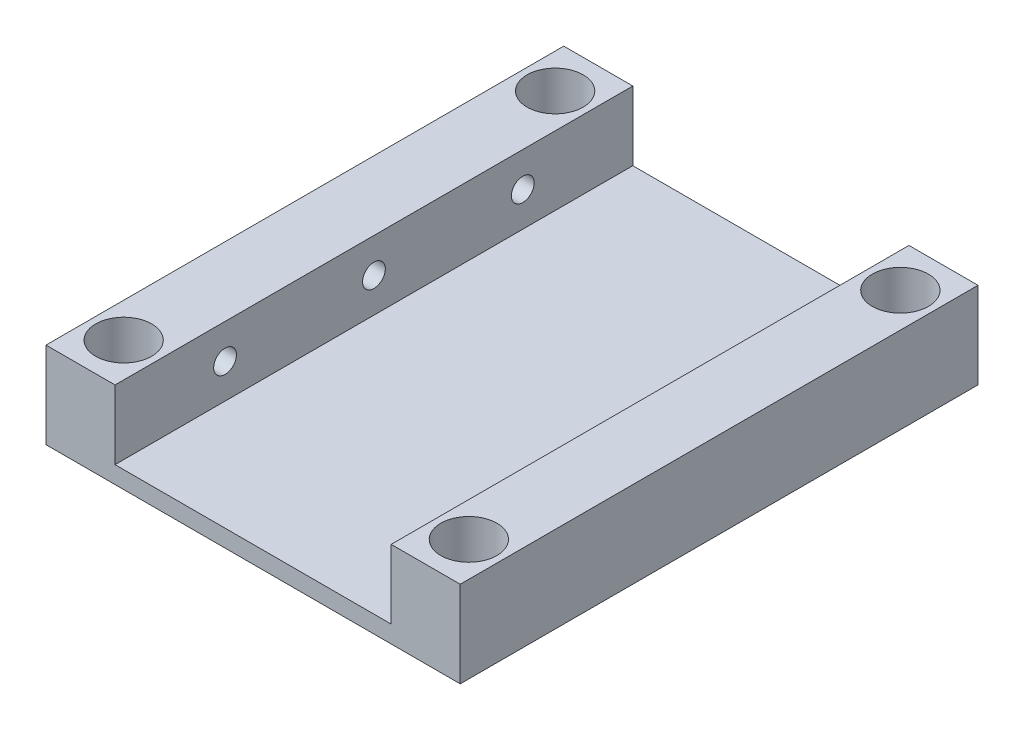
ISO-10303-21;
HEADER;
FILE_DESCRIPTION(('STEP AP214'),'2;1');
FILE_NAME('part.step','',(''),(''),'','','');
FILE_SCHEMA(('AUTOMOTIVE_DESIGN { 1 0 10303 214 1 1 1 1 }'));
ENDSEC;
DATA;
#1=APPLICATION_CONTEXT('core data for automotive mechanical design processes');
#2=APPLICATION_PROTOCOL_DEFINITION('international standard','automotive_design',2000,#1);
#3=PRODUCT_CONTEXT('',#1,'mechanical');
#4=PRODUCT('Part','Part','',(#3));
#5=PRODUCT_RELATED_PRODUCT_CATEGORY('part','',(#4));
#6=PRODUCT_DEFINITION_FORMATION('','',#4);
#7=PRODUCT_DEFINITION_CONTEXT('part definition',#1,'design');
#8=PRODUCT_DEFINITION('design','',#6,#7);
#9=PRODUCT_DEFINITION_SHAPE('','',#8);
#10=(LENGTH_UNIT() NAMED_UNIT(*) SI_UNIT(.MILLI.,.METRE.));
#11=(NAMED_UNIT(*) PLANE_ANGLE_UNIT() SI_UNIT($,.RADIAN.));
#12=(NAMED_UNIT(*) SI_UNIT($,.STERADIAN.) SOLID_ANGLE_UNIT());
#13=UNCERTAINTY_MEASURE_WITH_UNIT(LENGTH_MEASURE(1.E-05),#10,'distance_accuracy_value','');
#14=(GEOMETRIC_REPRESENTATION_CONTEXT(3) GLOBAL_UNCERTAINTY_ASSIGNED_CONTEXT((#13)) GLOBAL_UNIT_ASSIGNED_CONTEXT((#10,
#11,#12)) REPRESENTATION_CONTEXT('',''));
#15=CARTESIAN_POINT('',(0.,0.,0.));
#16=DIRECTION('',(0.,0.,1.));
#17=DIRECTION('',(1.,0.,0.));
#18=AXIS2_PLACEMENT_3D('',#15,#16,#17);
#19=CARTESIAN_POINT('',(0.001000000000001,6.00000000000002,47.2499999999997));
#20=DIRECTION('',(-1.,0.,0.));
#21=DIRECTION('',(0.,0.,1.));
#22=AXIS2_PLACEMENT_3D('',#19,#20,#21);
#23=CYLINDRICAL_SURFACE('',#22,1.32);
#24=CARTESIAN_POINT('',(-40.,6.00000000000002,47.2499999999997));
#25=DIRECTION('',(-1.,0.,0.));
#26=DIRECTION('',(0.,-1.,0.));
#27=AXIS2_PLACEMENT_3D('',#24,#25,#26);
#28=CIRCLE('',#27,1.32);
#29=CARTESIAN_POINT('',(-40.,4.68000000000002,47.2499999999997));
#30=VERTEX_POINT('',#29);
#31=EDGE_CURVE('E178',#30,#30,#28,.F.);
#32=ORIENTED_EDGE('',*,*,#31,.T.);
#33=EDGE_LOOP('',(#32));
#34=FACE_BOUND('',#33,.T.);
#35=CARTESIAN_POINT('',(-42.,6.00000000000002,47.2499999999997));
#36=DIRECTION('',(-1.,0.,0.));
#37=DIRECTION('',(0.,0.,1.));
#38=AXIS2_PLACEMENT_3D('',#35,#36,#37);
#39=CIRCLE('',#38,1.32);
#40=CARTESIAN_POINT('',(-42.,6.00000000000002,48.5699999999997));
#41=VERTEX_POINT('',#40);
#42=EDGE_CURVE('E37',#41,#41,#39,.F.);
#43=ORIENTED_EDGE('',*,*,#42,.F.);
#44=EDGE_LOOP('',(#43));
#45=FACE_BOUND('',#44,.T.);
#46=ADVANCED_FACE('F33',(#34,#45),#23,.F.);
#47=CARTESIAN_POINT('',(0.001000000000001,6.00000000000001,29.9999999999999));
#48=DIRECTION('',(-1.,0.,0.));
#49=DIRECTION('',(0.,0.,1.));
#50=AXIS2_PLACEMENT_3D('',#47,#48,#49);
#51=CYLINDRICAL_SURFACE('',#50,1.31999999999999);
#52=CARTESIAN_POINT('',(-40.,6.00000000000001,29.9999999999999));
#53=DIRECTION('',(-1.,0.,0.));
#54=DIRECTION('',(0.,-1.,0.));
#55=AXIS2_PLACEMENT_3D('',#52,#53,#54);
#56=CIRCLE('',#55,1.31999999999999);
#57=CARTESIAN_POINT('',(-40.,4.68000000000002,29.9999999999999));
#58=VERTEX_POINT('',#57);
#59=EDGE_CURVE('E203',#58,#58,#56,.F.);
#60=ORIENTED_EDGE('',*,*,#59,.T.);
#61=EDGE_LOOP('',(#60));
#62=FACE_BOUND('',#61,.T.);
#63=CARTESIAN_POINT('',(-42.,6.00000000000001,29.9999999999999));
#64=DIRECTION('',(-1.,0.,0.));
#65=DIRECTION('',(0.,0.,1.));
#66=AXIS2_PLACEMENT_3D('',#63,#64,#65);
#67=CIRCLE('',#66,1.31999999999999);
#68=CARTESIAN_POINT('',(-42.,6.00000000000001,31.3199999999998));
#69=VERTEX_POINT('',#68);
#70=EDGE_CURVE('E180',#69,#69,#67,.F.);
#71=ORIENTED_EDGE('',*,*,#70,.F.);
#72=EDGE_LOOP('',(#71));
#73=FACE_BOUND('',#72,.T.);
#74=ADVANCED_FACE('F276',(#62,#73),#51,.F.);
#75=CARTESIAN_POINT('',(0.001000000000001,6.00000000000002,12.75));
#76=DIRECTION('',(-1.,0.,0.));
#77=DIRECTION('',(0.,0.,1.));
#78=AXIS2_PLACEMENT_3D('',#75,#76,#77);
#79=CYLINDRICAL_SURFACE('',#78,1.32);
#80=CARTESIAN_POINT('',(-40.,6.00000000000002,12.75));
#81=DIRECTION('',(-1.,0.,0.));
#82=DIRECTION('',(0.,-1.,0.));
#83=AXIS2_PLACEMENT_3D('',#80,#81,#82);
#84=CIRCLE('',#83,1.32);
#85=CARTESIAN_POINT('',(-40.,4.68000000000002,12.75));
#86=VERTEX_POINT('',#85);
#87=EDGE_CURVE('E206',#86,#86,#84,.F.);
#88=ORIENTED_EDGE('',*,*,#87,.T.);
#89=EDGE_LOOP('',(#88));
#90=FACE_BOUND('',#89,.T.);
#91=CARTESIAN_POINT('',(-42.,6.00000000000002,12.75));
#92=DIRECTION('',(-1.,0.,0.));
#93=DIRECTION('',(0.,0.,1.));
#94=AXIS2_PLACEMENT_3D('',#91,#92,#93);
#95=CIRCLE('',#94,1.32);
#96=CARTESIAN_POINT('',(-42.,6.00000000000002,14.07));
#97=VERTEX_POINT('',#96);
#98=EDGE_CURVE('E176',#97,#97,#95,.F.);
#99=ORIENTED_EDGE('',*,*,#98,.F.);
#100=EDGE_LOOP('',(#99));
#101=FACE_BOUND('',#100,.T.);
#102=ADVANCED_FACE('F282',(#90,#101),#79,.F.);
#103=CARTESIAN_POINT('',(0.,9.99999999999999,60.));
#104=DIRECTION('',(-1.,0.,0.));
#105=DIRECTION('',(0.,-1.,0.));
#106=AXIS2_PLACEMENT_3D('',#103,#104,#105);
#107=PLANE('',#106);
#108=DIRECTION('',(0.,1.,0.));
#109=VECTOR('',#108,1.);
#110=CARTESIAN_POINT('',(0.,9.99999999999999,0.));
#111=LINE('',#110,#109);
#112=CARTESIAN_POINT('',(0.,0.,0.));
#113=VERTEX_POINT('',#112);
#114=CARTESIAN_POINT('',(0.,9.99999999999999,0.));
#115=VERTEX_POINT('',#114);
#116=EDGE_CURVE('E132',#113,#115,#111,.T.);
#117=ORIENTED_EDGE('',*,*,#116,.T.);
#118=DIRECTION('',(0.,0.,-1.));
#119=VECTOR('',#118,1.);
#120=CARTESIAN_POINT('',(0.,9.99999999999999,60.));
#121=LINE('',#120,#119);
#122=CARTESIAN_POINT('',(0.,9.99999999999999,60.));
#123=VERTEX_POINT('',#122);
#124=EDGE_CURVE('E11',#123,#115,#121,.T.);
#125=ORIENTED_EDGE('',*,*,#124,.F.);
#126=DIRECTION('',(0.,1.,0.));
#127=VECTOR('',#126,1.);
#128=CARTESIAN_POINT('',(0.,9.99999999999999,60.));
#129=LINE('',#128,#127);
#130=CARTESIAN_POINT('',(0.,0.,60.));
#131=VERTEX_POINT('',#130);
#132=EDGE_CURVE('E147',#131,#123,#129,.T.);
#133=ORIENTED_EDGE('',*,*,#132,.F.);
#134=DIRECTION('',(0.,0.,-1.));
#135=VECTOR('',#134,1.);
#136=CARTESIAN_POINT('',(0.,0.,60.));
#137=LINE('',#136,#135);
#138=EDGE_CURVE('E128',#131,#113,#137,.T.);
#139=ORIENTED_EDGE('',*,*,#138,.T.);
#140=EDGE_LOOP('',(#117,#125,#133,#139));
#141=FACE_BOUND('',#140,.T.);
#142=ADVANCED_FACE('F35',(#141),#107,.F.);
#143=CARTESIAN_POINT('',(-8.,10.,60.));
#144=DIRECTION('',(0.,-1.,0.));
#145=DIRECTION('',(1.,0.,0.));
#146=AXIS2_PLACEMENT_3D('',#143,#144,#145);
#147=PLANE('',#146);
#148=CARTESIAN_POINT('',(-4.00000000000001,10.,55.));
#149=DIRECTION('',(0.,1.,0.));
#150=DIRECTION('',(-1.,0.,0.));
#151=AXIS2_PLACEMENT_3D('',#148,#149,#150);
#152=CIRCLE('',#151,3.25000000000001);
#153=CARTESIAN_POINT('',(-7.25000000000002,10.,55.));
#154=VERTEX_POINT('',#153);
#155=EDGE_CURVE('E220',#154,#154,#152,.T.);
#156=ORIENTED_EDGE('',*,*,#155,.F.);
#157=EDGE_LOOP('',(#156));
#158=FACE_BOUND('',#157,.T.);
#159=CARTESIAN_POINT('',(-4.,10.,5.));
#160=DIRECTION('',(0.,1.,0.));
#161=DIRECTION('',(-1.,0.,0.));
#162=AXIS2_PLACEMENT_3D('',#159,#160,#161);
#163=CIRCLE('',#162,3.25000000000001);
#164=CARTESIAN_POINT('',(-7.25000000000001,10.,5.));
#165=VERTEX_POINT('',#164);
#166=EDGE_CURVE('E226',#165,#165,#163,.T.);
#167=ORIENTED_EDGE('',*,*,#166,.F.);
#168=EDGE_LOOP('',(#167));
#169=FACE_BOUND('',#168,.T.);
#170=DIRECTION('',(-1.,0.,0.));
#171=VECTOR('',#170,1.);
#172=CARTESIAN_POINT('',(-8.,10.,0.));
#173=LINE('',#172,#171);
#174=CARTESIAN_POINT('',(-8.,10.,0.));
#175=VERTEX_POINT('',#174);
#176=EDGE_CURVE('E135',#115,#175,#173,.T.);
#177=ORIENTED_EDGE('',*,*,#176,.T.);
#178=DIRECTION('',(0.,0.,-1.));
#179=VECTOR('',#178,1.);
#180=CARTESIAN_POINT('',(-8.,10.,60.));
#181=LINE('',#180,#179);
#182=CARTESIAN_POINT('',(-8.,10.,60.));
#183=VERTEX_POINT('',#182);
#184=EDGE_CURVE('E43',#183,#175,#181,.T.);
#185=ORIENTED_EDGE('',*,*,#184,.F.);
#186=DIRECTION('',(-1.,0.,0.));
#187=VECTOR('',#186,1.);
#188=CARTESIAN_POINT('',(-8.,10.,60.));
#189=LINE('',#188,#187);
#190=EDGE_CURVE('E95',#123,#183,#189,.T.);
#191=ORIENTED_EDGE('',*,*,#190,.F.);
#192=ORIENTED_EDGE('',*,*,#124,.T.);
#193=EDGE_LOOP('',(#177,#185,#191,#192));
#194=FACE_BOUND('',#193,.T.);
#195=ADVANCED_FACE('F535',(#158,#169,#194),#147,.F.);
#196=CARTESIAN_POINT('',(-8.,2.,60.));
#197=DIRECTION('',(1.,0.,0.));
#198=DIRECTION('',(0.,1.,0.));
#199=AXIS2_PLACEMENT_3D('',#196,#197,#198);
#200=PLANE('',#199);
#201=DIRECTION('',(0.,-1.,0.));
#202=VECTOR('',#201,1.);
#203=CARTESIAN_POINT('',(-8.,2.,0.));
#204=LINE('',#203,#202);
#205=CARTESIAN_POINT('',(-8.,2.,0.));
#206=VERTEX_POINT('',#205);
#207=EDGE_CURVE('E138',#175,#206,#204,.T.);
#208=ORIENTED_EDGE('',*,*,#207,.T.);
#209=DIRECTION('',(0.,0.,-1.));
#210=VECTOR('',#209,1.);
#211=CARTESIAN_POINT('',(-8.,2.,60.));
#212=LINE('',#211,#210);
#213=CARTESIAN_POINT('',(-8.,2.,60.));
#214=VERTEX_POINT('',#213);
#215=EDGE_CURVE('E154',#214,#206,#212,.T.);
#216=ORIENTED_EDGE('',*,*,#215,.F.);
#217=DIRECTION('',(0.,-1.,0.));
#218=VECTOR('',#217,1.);
#219=CARTESIAN_POINT('',(-8.,2.,60.));
#220=LINE('',#219,#218);
#221=EDGE_CURVE('E241',#183,#214,#220,.T.);
#222=ORIENTED_EDGE('',*,*,#221,.F.);
#223=ORIENTED_EDGE('',*,*,#184,.T.);
#224=EDGE_LOOP('',(#208,#216,#222,#223));
#225=FACE_BOUND('',#224,.T.);
#226=ADVANCED_FACE('F527',(#225),#200,.F.);
#227=CARTESIAN_POINT('',(-40.,2.,60.));
#228=DIRECTION('',(0.,-1.,0.));
#229=DIRECTION('',(1.,0.,0.));
#230=AXIS2_PLACEMENT_3D('',#227,#228,#229);
#231=PLANE('',#230);
#232=DIRECTION('',(-1.,0.,0.));
#233=VECTOR('',#232,1.);
#234=CARTESIAN_POINT('',(-40.,2.,0.));
#235=LINE('',#234,#233);
#236=CARTESIAN_POINT('',(-40.,2.,0.));
#237=VERTEX_POINT('',#236);
#238=EDGE_CURVE('E140',#206,#237,#235,.T.);
#239=ORIENTED_EDGE('',*,*,#238,.T.);
#240=DIRECTION('',(0.,0.,-1.));
#241=VECTOR('',#240,1.);
#242=CARTESIAN_POINT('',(-40.,2.,60.));
#243=LINE('',#242,#241);
#244=CARTESIAN_POINT('',(-40.,2.,60.));
#245=VERTEX_POINT('',#244);
#246=EDGE_CURVE('E151',#245,#237,#243,.T.);
#247=ORIENTED_EDGE('',*,*,#246,.F.);
#248=DIRECTION('',(-1.,0.,0.));
#249=VECTOR('',#248,1.);
#250=CARTESIAN_POINT('',(-40.,2.,60.));
#251=LINE('',#250,#249);
#252=EDGE_CURVE('E243',#214,#245,#251,.T.);
#253=ORIENTED_EDGE('',*,*,#252,.F.);
#254=ORIENTED_EDGE('',*,*,#215,.T.);
#255=EDGE_LOOP('',(#239,#247,#253,#254));
#256=FACE_BOUND('',#255,.T.);
#257=ADVANCED_FACE('F249',(#256),#231,.F.);
#258=CARTESIAN_POINT('',(-40.,10.,60.));
#259=DIRECTION('',(-1.,0.,0.));
#260=DIRECTION('',(0.,-1.,0.));
#261=AXIS2_PLACEMENT_3D('',#258,#259,#260);
#262=PLANE('',#261);
#263=ORIENTED_EDGE('',*,*,#31,.F.);
#264=EDGE_LOOP('',(#263));
#265=FACE_BOUND('',#264,.T.);
#266=ORIENTED_EDGE('',*,*,#59,.F.);
#267=EDGE_LOOP('',(#266));
#268=FACE_BOUND('',#267,.T.);
#269=ORIENTED_EDGE('',*,*,#87,.F.);
#270=EDGE_LOOP('',(#269));
#271=FACE_BOUND('',#270,.T.);
#272=DIRECTION('',(0.,1.,0.));
#273=VECTOR('',#272,1.);
#274=CARTESIAN_POINT('',(-40.,10.,0.));
#275=LINE('',#274,#273);
#276=CARTESIAN_POINT('',(-40.,10.,0.));
#277=VERTEX_POINT('',#276);
#278=EDGE_CURVE('E142',#237,#277,#275,.T.);
#279=ORIENTED_EDGE('',*,*,#278,.T.);
#280=DIRECTION('',(0.,0.,-1.));
#281=VECTOR('',#280,1.);
#282=CARTESIAN_POINT('',(-40.,10.,60.));
#283=LINE('',#282,#281);
#284=CARTESIAN_POINT('',(-40.,10.,60.));
#285=VERTEX_POINT('',#284);
#286=EDGE_CURVE('E123',#285,#277,#283,.T.);
#287=ORIENTED_EDGE('',*,*,#286,.F.);
#288=DIRECTION('',(0.,1.,0.));
#289=VECTOR('',#288,1.);
#290=CARTESIAN_POINT('',(-40.,10.,60.));
#291=LINE('',#290,#289);
#292=EDGE_CURVE('E114',#245,#285,#291,.T.);
#293=ORIENTED_EDGE('',*,*,#292,.F.);
#294=ORIENTED_EDGE('',*,*,#246,.T.);
#295=EDGE_LOOP('',(#279,#287,#293,#294));
#296=FACE_BOUND('',#295,.T.);
#297=ADVANCED_FACE('F253',(#265,#268,#271,#296),#262,.F.);
#298=CARTESIAN_POINT('',(-48.,9.99999999999999,60.));
#299=DIRECTION('',(0.,-1.,0.));
#300=DIRECTION('',(1.,0.,0.));
#301=AXIS2_PLACEMENT_3D('',#298,#299,#300);
#302=PLANE('',#301);
#303=CARTESIAN_POINT('',(-44.,10.,55.));
#304=DIRECTION('',(0.,1.,0.));
#305=DIRECTION('',(-1.,0.,0.));
#306=AXIS2_PLACEMENT_3D('',#303,#304,#305);
#307=CIRCLE('',#306,3.25000000000031);
#308=CARTESIAN_POINT('',(-47.2500000000003,10.,55.));
#309=VERTEX_POINT('',#308);
#310=EDGE_CURVE('E162',#309,#309,#307,.T.);
#311=ORIENTED_EDGE('',*,*,#310,.F.);
#312=EDGE_LOOP('',(#311));
#313=FACE_BOUND('',#312,.T.);
#314=CARTESIAN_POINT('',(-44.,10.,5.));
#315=DIRECTION('',(0.,1.,0.));
#316=DIRECTION('',(-1.,0.,0.));
#317=AXIS2_PLACEMENT_3D('',#314,#315,#316);
#318=CIRCLE('',#317,3.25000000000001);
#319=CARTESIAN_POINT('',(-47.25,10.,5.));
#320=VERTEX_POINT('',#319);
#321=EDGE_CURVE('E232',#320,#320,#318,.T.);
#322=ORIENTED_EDGE('',*,*,#321,.F.);
#323=EDGE_LOOP('',(#322));
#324=FACE_BOUND('',#323,.T.);
#325=DIRECTION('',(-1.,0.,0.));
#326=VECTOR('',#325,1.);
#327=CARTESIAN_POINT('',(-48.,9.99999999999999,0.));
#328=LINE('',#327,#326);
#329=CARTESIAN_POINT('',(-48.,9.99999999999999,0.));
#330=VERTEX_POINT('',#329);
#331=EDGE_CURVE('E122',#277,#330,#328,.T.);
#332=ORIENTED_EDGE('',*,*,#331,.T.);
#333=DIRECTION('',(0.,0.,-1.));
#334=VECTOR('',#333,1.);
#335=CARTESIAN_POINT('',(-48.,9.99999999999999,60.));
#336=LINE('',#335,#334);
#337=CARTESIAN_POINT('',(-48.,9.99999999999999,60.));
#338=VERTEX_POINT('',#337);
#339=EDGE_CURVE('E119',#338,#330,#336,.T.);
#340=ORIENTED_EDGE('',*,*,#339,.F.);
#341=DIRECTION('',(-1.,0.,0.));
#342=VECTOR('',#341,1.);
#343=CARTESIAN_POINT('',(-48.,9.99999999999999,60.));
#344=LINE('',#343,#342);
#345=EDGE_CURVE('E108',#285,#338,#344,.T.);
#346=ORIENTED_EDGE('',*,*,#345,.F.);
#347=ORIENTED_EDGE('',*,*,#286,.T.);
#348=EDGE_LOOP('',(#332,#340,#346,#347));
#349=FACE_BOUND('',#348,.T.);
#350=ADVANCED_FACE('F120',(#313,#324,#349),#302,.F.);
#351=CARTESIAN_POINT('',(-48.,0.,60.));
#352=DIRECTION('',(1.,0.,0.));
#353=DIRECTION('',(0.,0.,-1.));
#354=AXIS2_PLACEMENT_3D('',#351,#352,#353);
#355=PLANE('',#354);
#356=CARTESIAN_POINT('',(-48.,6.,47.2499999999997));
#357=DIRECTION('',(-1.,0.,0.));
#358=DIRECTION('',(0.,0.,1.));
#359=AXIS2_PLACEMENT_3D('',#356,#357,#358);
#360=CIRCLE('',#359,3.25000000000001);
#361=CARTESIAN_POINT('',(-48.,6.,50.4999999999997));
#362=VERTEX_POINT('',#361);
#363=EDGE_CURVE('E196',#362,#362,#360,.T.);
#364=ORIENTED_EDGE('',*,*,#363,.F.);
#365=EDGE_LOOP('',(#364));
#366=FACE_BOUND('',#365,.T.);
#367=CARTESIAN_POINT('',(-48.,6.00000000000001,29.9999999999999));
#368=DIRECTION('',(-1.,0.,0.));
#369=DIRECTION('',(0.,0.,1.));
#370=AXIS2_PLACEMENT_3D('',#367,#368,#369);
#371=CIRCLE('',#370,3.25);
#372=CARTESIAN_POINT('',(-48.,6.00000000000001,33.2499999999999));
#373=VERTEX_POINT('',#372);
#374=EDGE_CURVE('E189',#373,#373,#371,.T.);
#375=ORIENTED_EDGE('',*,*,#374,.F.);
#376=EDGE_LOOP('',(#375));
#377=FACE_BOUND('',#376,.T.);
#378=CARTESIAN_POINT('',(-48.,6.00000000000002,12.75));
#379=DIRECTION('',(-1.,0.,0.));
#380=DIRECTION('',(0.,0.,1.));
#381=AXIS2_PLACEMENT_3D('',#378,#379,#380);
#382=CIRCLE('',#381,3.25);
#383=CARTESIAN_POINT('',(-48.,6.00000000000002,16.));
#384=VERTEX_POINT('',#383);
#385=EDGE_CURVE('E182',#384,#384,#382,.T.);
#386=ORIENTED_EDGE('',*,*,#385,.F.);
#387=EDGE_LOOP('',(#386));
#388=FACE_BOUND('',#387,.T.);
#389=DIRECTION('',(0.,-1.,0.));
#390=VECTOR('',#389,1.);
#391=CARTESIAN_POINT('',(-48.,0.,0.));
#392=LINE('',#391,#390);
#393=CARTESIAN_POINT('',(-48.,0.,0.));
#394=VERTEX_POINT('',#393);
#395=EDGE_CURVE('E81',#330,#394,#392,.T.);
#396=ORIENTED_EDGE('',*,*,#395,.T.);
#397=DIRECTION('',(0.,0.,-1.));
#398=VECTOR('',#397,1.);
#399=CARTESIAN_POINT('',(-48.,0.,60.));
#400=LINE('',#399,#398);
#401=CARTESIAN_POINT('',(-48.,0.,60.));
#402=VERTEX_POINT('',#401);
#403=EDGE_CURVE('E124',#402,#394,#400,.T.);
#404=ORIENTED_EDGE('',*,*,#403,.F.);
#405=DIRECTION('',(0.,-1.,0.));
#406=VECTOR('',#405,1.);
#407=CARTESIAN_POINT('',(-48.,0.,60.));
#408=LINE('',#407,#406);
#409=EDGE_CURVE('E112',#338,#402,#408,.T.);
#410=ORIENTED_EDGE('',*,*,#409,.F.);
#411=ORIENTED_EDGE('',*,*,#339,.T.);
#412=EDGE_LOOP('',(#396,#404,#410,#411));
#413=FACE_BOUND('',#412,.T.);
#414=ADVANCED_FACE('F126',(#366,#377,#388,#413),#355,.F.);
#415=CARTESIAN_POINT('',(0.,0.,60.));
#416=DIRECTION('',(0.,1.,0.));
#417=DIRECTION('',(-1.,0.,0.));
#418=AXIS2_PLACEMENT_3D('',#415,#416,#417);
#419=PLANE('',#418);
#420=CARTESIAN_POINT('',(-43.9999999999995,0.,5.));
#421=DIRECTION('',(0.,-1.,0.));
#422=DIRECTION('',(1.,0.,0.));
#423=AXIS2_PLACEMENT_3D('',#420,#421,#422);
#424=CIRCLE('',#423,2.);
#425=CARTESIAN_POINT('',(-41.9999999999995,0.,5.));
#426=VERTEX_POINT('',#425);
#427=EDGE_CURVE('E175',#426,#426,#424,.T.);
#428=ORIENTED_EDGE('',*,*,#427,.F.);
#429=EDGE_LOOP('',(#428));
#430=FACE_BOUND('',#429,.T.);
#431=CARTESIAN_POINT('',(-3.99999999999948,0.,5.));
#432=DIRECTION('',(0.,-1.,0.));
#433=DIRECTION('',(1.,0.,0.));
#434=AXIS2_PLACEMENT_3D('',#431,#432,#433);
#435=CIRCLE('',#434,2.);
#436=CARTESIAN_POINT('',(-1.99999999999948,0.,5.));
#437=VERTEX_POINT('',#436);
#438=EDGE_CURVE('E171',#437,#437,#435,.T.);
#439=ORIENTED_EDGE('',*,*,#438,.F.);
#440=EDGE_LOOP('',(#439));
#441=FACE_BOUND('',#440,.T.);
#442=CARTESIAN_POINT('',(-4.00000000000001,0.,55.));
#443=DIRECTION('',(0.,-1.,0.));
#444=DIRECTION('',(1.,0.,0.));
#445=AXIS2_PLACEMENT_3D('',#442,#443,#444);
#446=CIRCLE('',#445,2.);
#447=CARTESIAN_POINT('',(-2.,0.,55.));
#448=VERTEX_POINT('',#447);
#449=EDGE_CURVE('E167',#448,#448,#446,.T.);
#450=ORIENTED_EDGE('',*,*,#449,.F.);
#451=EDGE_LOOP('',(#450));
#452=FACE_BOUND('',#451,.T.);
#453=CARTESIAN_POINT('',(-44.,0.,55.));
#454=DIRECTION('',(0.,-1.,0.));
#455=DIRECTION('',(1.,0.,0.));
#456=AXIS2_PLACEMENT_3D('',#453,#454,#455);
#457=CIRCLE('',#456,2.);
#458=CARTESIAN_POINT('',(-42.,0.,55.));
#459=VERTEX_POINT('',#458);
#460=EDGE_CURVE('E163',#459,#459,#457,.T.);
#461=ORIENTED_EDGE('',*,*,#460,.F.);
#462=EDGE_LOOP('',(#461));
#463=FACE_BOUND('',#462,.T.);
#464=DIRECTION('',(1.,0.,0.));
#465=VECTOR('',#464,1.);
#466=CARTESIAN_POINT('',(0.,0.,0.));
#467=LINE('',#466,#465);
#468=EDGE_CURVE('E87',#394,#113,#467,.T.);
#469=ORIENTED_EDGE('',*,*,#468,.T.);
#470=ORIENTED_EDGE('',*,*,#138,.F.);
#471=DIRECTION('',(1.,0.,0.));
#472=VECTOR('',#471,1.);
#473=CARTESIAN_POINT('',(0.,0.,60.));
#474=LINE('',#473,#472);
#475=EDGE_CURVE('E52',#402,#131,#474,.T.);
#476=ORIENTED_EDGE('',*,*,#475,.F.);
#477=ORIENTED_EDGE('',*,*,#403,.T.);
#478=EDGE_LOOP('',(#469,#470,#476,#477));
#479=FACE_BOUND('',#478,.T.);
#480=ADVANCED_FACE('F261',(#430,#441,#452,#463,#479),#419,.F.);
#481=CARTESIAN_POINT('',(0.,0.,60.));
#482=DIRECTION('',(0.,0.,-1.));
#483=DIRECTION('',(-1.,0.,0.));
#484=AXIS2_PLACEMENT_3D('',#481,#482,#483);
#485=PLANE('',#484);
#486=ORIENTED_EDGE('',*,*,#132,.T.);
#487=ORIENTED_EDGE('',*,*,#190,.T.);
#488=ORIENTED_EDGE('',*,*,#221,.T.);
#489=ORIENTED_EDGE('',*,*,#252,.T.);
#490=ORIENTED_EDGE('',*,*,#292,.T.);
#491=ORIENTED_EDGE('',*,*,#345,.T.);
#492=ORIENTED_EDGE('',*,*,#409,.T.);
#493=ORIENTED_EDGE('',*,*,#475,.T.);
#494=EDGE_LOOP('',(#486,#487,#488,#489,#490,#491,#492,#493));
#495=FACE_BOUND('',#494,.T.);
#496=ADVANCED_FACE('F110',(#495),#485,.F.);
#497=CARTESIAN_POINT('',(0.,0.,0.));
#498=DIRECTION('',(0.,0.,-1.));
#499=DIRECTION('',(-1.,0.,0.));
#500=AXIS2_PLACEMENT_3D('',#497,#498,#499);
#501=PLANE('',#500);
#502=ORIENTED_EDGE('',*,*,#116,.F.);
#503=ORIENTED_EDGE('',*,*,#468,.F.);
#504=ORIENTED_EDGE('',*,*,#395,.F.);
#505=ORIENTED_EDGE('',*,*,#331,.F.);
#506=ORIENTED_EDGE('',*,*,#278,.F.);
#507=ORIENTED_EDGE('',*,*,#238,.F.);
#508=ORIENTED_EDGE('',*,*,#207,.F.);
#509=ORIENTED_EDGE('',*,*,#176,.F.);
#510=EDGE_LOOP('',(#502,#503,#504,#505,#506,#507,#508,#509));
#511=FACE_BOUND('',#510,.T.);
#512=ADVANCED_FACE('F256',(#511),#501,.T.);
#513=CARTESIAN_POINT('',(-44.,2.00000000000001,5.));
#514=DIRECTION('',(0.,1.,0.));
#515=DIRECTION('',(-1.,0.,0.));
#516=AXIS2_PLACEMENT_3D('',#513,#514,#515);
#517=CYLINDRICAL_SURFACE('',#516,3.25000000000001);
#518=CARTESIAN_POINT('',(-44.,2.00000000000001,5.));
#519=DIRECTION('',(0.,1.,0.));
#520=DIRECTION('',(-1.,0.,0.));
#521=AXIS2_PLACEMENT_3D('',#518,#519,#520);
#522=CIRCLE('',#521,3.25000000000001);
#523=CARTESIAN_POINT('',(-47.25,2.00000000000001,5.));
#524=VERTEX_POINT('',#523);
#525=EDGE_CURVE('E136',#524,#524,#522,.T.);
#526=ORIENTED_EDGE('',*,*,#525,.F.);
#527=EDGE_LOOP('',(#526));
#528=FACE_BOUND('',#527,.T.);
#529=ORIENTED_EDGE('',*,*,#321,.T.);
#530=EDGE_LOOP('',(#529));
#531=FACE_BOUND('',#530,.T.);
#532=ADVANCED_FACE('F337',(#528,#531),#517,.F.);
#533=CARTESIAN_POINT('',(-44.,2.00000000000001,5.));
#534=DIRECTION('',(0.,1.,0.));
#535=DIRECTION('',(-1.,0.,0.));
#536=AXIS2_PLACEMENT_3D('',#533,#534,#535);
#537=PLANE('',#536);
#538=CARTESIAN_POINT('',(-43.9999999999995,2.00000000000001,5.));
#539=DIRECTION('',(0.,1.,0.));
#540=DIRECTION('',(-1.,0.,0.));
#541=AXIS2_PLACEMENT_3D('',#538,#539,#540);
#542=CIRCLE('',#541,2.);
#543=CARTESIAN_POINT('',(-45.9999999999995,2.00000000000001,5.));
#544=VERTEX_POINT('',#543);
#545=EDGE_CURVE('E172',#544,#544,#542,.T.);
#546=ORIENTED_EDGE('',*,*,#545,.F.);
#547=EDGE_LOOP('',(#546));
#548=FACE_BOUND('',#547,.T.);
#549=ORIENTED_EDGE('',*,*,#525,.T.);
#550=EDGE_LOOP('',(#549));
#551=FACE_BOUND('',#550,.T.);
#552=ADVANCED_FACE('F333',(#548,#551),#537,.T.);
#553=CARTESIAN_POINT('',(-4.,2.00000000000002,5.));
#554=DIRECTION('',(0.,1.,0.));
#555=DIRECTION('',(-1.,0.,0.));
#556=AXIS2_PLACEMENT_3D('',#553,#554,#555);
#557=CYLINDRICAL_SURFACE('',#556,3.25000000000001);
#558=CARTESIAN_POINT('',(-4.,2.00000000000002,5.));
#559=DIRECTION('',(0.,1.,0.));
#560=DIRECTION('',(-1.,0.,0.));
#561=AXIS2_PLACEMENT_3D('',#558,#559,#560);
#562=CIRCLE('',#561,3.25000000000001);
#563=CARTESIAN_POINT('',(-7.25000000000001,2.00000000000002,5.));
#564=VERTEX_POINT('',#563);
#565=EDGE_CURVE('E229',#564,#564,#562,.T.);
#566=ORIENTED_EDGE('',*,*,#565,.F.);
#567=EDGE_LOOP('',(#566));
#568=FACE_BOUND('',#567,.T.);
#569=ORIENTED_EDGE('',*,*,#166,.T.);
#570=EDGE_LOOP('',(#569));
#571=FACE_BOUND('',#570,.T.);
#572=ADVANCED_FACE('F329',(#568,#571),#557,.F.);
#573=CARTESIAN_POINT('',(-4.,2.00000000000002,5.));
#574=DIRECTION('',(0.,1.,0.));
#575=DIRECTION('',(-1.,0.,0.));
#576=AXIS2_PLACEMENT_3D('',#573,#574,#575);
#577=PLANE('',#576);
#578=CARTESIAN_POINT('',(-3.99999999999948,2.00000000000002,5.));
#579=DIRECTION('',(0.,1.,0.));
#580=DIRECTION('',(-1.,0.,0.));
#581=AXIS2_PLACEMENT_3D('',#578,#579,#580);
#582=CIRCLE('',#581,2.);
#583=CARTESIAN_POINT('',(-5.99999999999948,2.00000000000002,5.));
#584=VERTEX_POINT('',#583);
#585=EDGE_CURVE('E168',#584,#584,#582,.T.);
#586=ORIENTED_EDGE('',*,*,#585,.F.);
#587=EDGE_LOOP('',(#586));
#588=FACE_BOUND('',#587,.T.);
#589=ORIENTED_EDGE('',*,*,#565,.T.);
#590=EDGE_LOOP('',(#589));
#591=FACE_BOUND('',#590,.T.);
#592=ADVANCED_FACE('F325',(#588,#591),#577,.T.);
#593=CARTESIAN_POINT('',(-4.00000000000001,2.00000000000002,55.));
#594=DIRECTION('',(0.,1.,0.));
#595=DIRECTION('',(-1.,0.,0.));
#596=AXIS2_PLACEMENT_3D('',#593,#594,#595);
#597=CYLINDRICAL_SURFACE('',#596,3.25000000000001);
#598=CARTESIAN_POINT('',(-4.00000000000001,2.00000000000002,55.));
#599=DIRECTION('',(0.,1.,0.));
#600=DIRECTION('',(-1.,0.,0.));
#601=AXIS2_PLACEMENT_3D('',#598,#599,#600);
#602=CIRCLE('',#601,3.25000000000001);
#603=CARTESIAN_POINT('',(-7.25000000000002,2.00000000000002,55.));
#604=VERTEX_POINT('',#603);
#605=EDGE_CURVE('E223',#604,#604,#602,.T.);
#606=ORIENTED_EDGE('',*,*,#605,.F.);
#607=EDGE_LOOP('',(#606));
#608=FACE_BOUND('',#607,.T.);
#609=ORIENTED_EDGE('',*,*,#155,.T.);
#610=EDGE_LOOP('',(#609));
#611=FACE_BOUND('',#610,.T.);
#612=ADVANCED_FACE('F321',(#608,#611),#597,.F.);
#613=CARTESIAN_POINT('',(-4.00000000000001,2.00000000000002,55.));
#614=DIRECTION('',(0.,1.,0.));
#615=DIRECTION('',(-1.,0.,0.));
#616=AXIS2_PLACEMENT_3D('',#613,#614,#615);
#617=PLANE('',#616);
#618=CARTESIAN_POINT('',(-4.00000000000001,2.00000000000002,55.));
#619=DIRECTION('',(0.,1.,0.));
#620=DIRECTION('',(-1.,0.,0.));
#621=AXIS2_PLACEMENT_3D('',#618,#619,#620);
#622=CIRCLE('',#621,2.);
#623=CARTESIAN_POINT('',(-6.00000000000001,2.00000000000002,55.));
#624=VERTEX_POINT('',#623);
#625=EDGE_CURVE('E164',#624,#624,#622,.T.);
#626=ORIENTED_EDGE('',*,*,#625,.F.);
#627=EDGE_LOOP('',(#626));
#628=FACE_BOUND('',#627,.T.);
#629=ORIENTED_EDGE('',*,*,#605,.T.);
#630=EDGE_LOOP('',(#629));
#631=FACE_BOUND('',#630,.T.);
#632=ADVANCED_FACE('F317',(#628,#631),#617,.T.);
#633=CARTESIAN_POINT('',(-44.,2.00000000000001,55.));
#634=DIRECTION('',(0.,1.,0.));
#635=DIRECTION('',(-1.,0.,0.));
#636=AXIS2_PLACEMENT_3D('',#633,#634,#635);
#637=CYLINDRICAL_SURFACE('',#636,3.25000000000031);
#638=CARTESIAN_POINT('',(-44.,2.00000000000001,55.));
#639=DIRECTION('',(0.,1.,0.));
#640=DIRECTION('',(-1.,0.,0.));
#641=AXIS2_PLACEMENT_3D('',#638,#639,#640);
#642=CIRCLE('',#641,3.25000000000031);
#643=CARTESIAN_POINT('',(-47.2500000000003,2.00000000000001,55.));
#644=VERTEX_POINT('',#643);
#645=EDGE_CURVE('E217',#644,#644,#642,.T.);
#646=ORIENTED_EDGE('',*,*,#645,.F.);
#647=EDGE_LOOP('',(#646));
#648=FACE_BOUND('',#647,.T.);
#649=ORIENTED_EDGE('',*,*,#310,.T.);
#650=EDGE_LOOP('',(#649));
#651=FACE_BOUND('',#650,.T.);
#652=ADVANCED_FACE('F313',(#648,#651),#637,.F.);
#653=CARTESIAN_POINT('',(-44.,2.00000000000001,55.));
#654=DIRECTION('',(0.,1.,0.));
#655=DIRECTION('',(-1.,0.,0.));
#656=AXIS2_PLACEMENT_3D('',#653,#654,#655);
#657=PLANE('',#656);
#658=CARTESIAN_POINT('',(-44.,2.00000000000001,55.));
#659=DIRECTION('',(0.,1.,0.));
#660=DIRECTION('',(-1.,0.,0.));
#661=AXIS2_PLACEMENT_3D('',#658,#659,#660);
#662=CIRCLE('',#661,2.);
#663=CARTESIAN_POINT('',(-46.,2.00000000000001,55.));
#664=VERTEX_POINT('',#663);
#665=EDGE_CURVE('E159',#664,#664,#662,.T.);
#666=ORIENTED_EDGE('',*,*,#665,.F.);
#667=EDGE_LOOP('',(#666));
#668=FACE_BOUND('',#667,.T.);
#669=ORIENTED_EDGE('',*,*,#645,.T.);
#670=EDGE_LOOP('',(#669));
#671=FACE_BOUND('',#670,.T.);
#672=ADVANCED_FACE('F309',(#668,#671),#657,.T.);
#673=CARTESIAN_POINT('',(-44.,7.99999999999999,55.));
#674=DIRECTION('',(0.,-1.,0.));
#675=DIRECTION('',(1.,0.,0.));
#676=AXIS2_PLACEMENT_3D('',#673,#674,#675);
#677=CYLINDRICAL_SURFACE('',#676,2.);
#678=ORIENTED_EDGE('',*,*,#665,.T.);
#679=EDGE_LOOP('',(#678));
#680=FACE_BOUND('',#679,.T.);
#681=ORIENTED_EDGE('',*,*,#460,.T.);
#682=EDGE_LOOP('',(#681));
#683=FACE_BOUND('',#682,.T.);
#684=ADVANCED_FACE('F305',(#680,#683),#677,.F.);
#685=CARTESIAN_POINT('',(-4.00000000000001,8.,55.));
#686=DIRECTION('',(0.,-1.,0.));
#687=DIRECTION('',(1.,0.,0.));
#688=AXIS2_PLACEMENT_3D('',#685,#686,#687);
#689=CYLINDRICAL_SURFACE('',#688,2.);
#690=ORIENTED_EDGE('',*,*,#625,.T.);
#691=EDGE_LOOP('',(#690));
#692=FACE_BOUND('',#691,.T.);
#693=ORIENTED_EDGE('',*,*,#449,.T.);
#694=EDGE_LOOP('',(#693));
#695=FACE_BOUND('',#694,.T.);
#696=ADVANCED_FACE('F301',(#692,#695),#689,.F.);
#697=CARTESIAN_POINT('',(-3.99999999999948,8.,5.));
#698=DIRECTION('',(0.,-1.,0.));
#699=DIRECTION('',(1.,0.,0.));
#700=AXIS2_PLACEMENT_3D('',#697,#698,#699);
#701=CYLINDRICAL_SURFACE('',#700,2.);
#702=ORIENTED_EDGE('',*,*,#585,.T.);
#703=EDGE_LOOP('',(#702));
#704=FACE_BOUND('',#703,.T.);
#705=ORIENTED_EDGE('',*,*,#438,.T.);
#706=EDGE_LOOP('',(#705));
#707=FACE_BOUND('',#706,.T.);
#708=ADVANCED_FACE('F297',(#704,#707),#701,.F.);
#709=CARTESIAN_POINT('',(-43.9999999999995,7.99999999999999,5.));
#710=DIRECTION('',(0.,-1.,0.));
#711=DIRECTION('',(1.,0.,0.));
#712=AXIS2_PLACEMENT_3D('',#709,#710,#711);
#713=CYLINDRICAL_SURFACE('',#712,2.);
#714=ORIENTED_EDGE('',*,*,#545,.T.);
#715=EDGE_LOOP('',(#714));
#716=FACE_BOUND('',#715,.T.);
#717=ORIENTED_EDGE('',*,*,#427,.T.);
#718=EDGE_LOOP('',(#717));
#719=FACE_BOUND('',#718,.T.);
#720=ADVANCED_FACE('F293',(#716,#719),#713,.F.);
#721=CARTESIAN_POINT('',(-42.,6.00000000000002,12.75));
#722=DIRECTION('',(-1.,0.,0.));
#723=DIRECTION('',(0.,0.,1.));
#724=AXIS2_PLACEMENT_3D('',#721,#722,#723);
#725=PLANE('',#724);
#726=CARTESIAN_POINT('',(-42.,6.00000000000002,12.75));
#727=DIRECTION('',(-1.,0.,0.));
#728=DIRECTION('',(0.,0.,1.));
#729=AXIS2_PLACEMENT_3D('',#726,#727,#728);
#730=CIRCLE('',#729,3.25);
#731=CARTESIAN_POINT('',(-42.,6.00000000000002,16.));
#732=VERTEX_POINT('',#731);
#733=EDGE_CURVE('E179',#732,#732,#730,.T.);
#734=ORIENTED_EDGE('',*,*,#733,.T.);
#735=EDGE_LOOP('',(#734));
#736=FACE_BOUND('',#735,.T.);
#737=ORIENTED_EDGE('',*,*,#98,.T.);
#738=EDGE_LOOP('',(#737));
#739=FACE_BOUND('',#738,.T.);
#740=ADVANCED_FACE('F296',(#736,#739),#725,.T.);
#741=CARTESIAN_POINT('',(-42.,6.00000000000002,12.75));
#742=DIRECTION('',(-1.,0.,0.));
#743=DIRECTION('',(0.,0.,1.));
#744=AXIS2_PLACEMENT_3D('',#741,#742,#743);
#745=CYLINDRICAL_SURFACE('',#744,3.25);
#746=ORIENTED_EDGE('',*,*,#733,.F.);
#747=EDGE_LOOP('',(#746));
#748=FACE_BOUND('',#747,.T.);
#749=ORIENTED_EDGE('',*,*,#385,.T.);
#750=EDGE_LOOP('',(#749));
#751=FACE_BOUND('',#750,.T.);
#752=ADVANCED_FACE('F287',(#748,#751),#745,.F.);
#753=CARTESIAN_POINT('',(-42.,6.00000000000001,29.9999999999999));
#754=DIRECTION('',(-1.,0.,0.));
#755=DIRECTION('',(0.,0.,1.));
#756=AXIS2_PLACEMENT_3D('',#753,#754,#755);
#757=PLANE('',#756);
#758=CARTESIAN_POINT('',(-42.,6.00000000000001,29.9999999999999));
#759=DIRECTION('',(-1.,0.,0.));
#760=DIRECTION('',(0.,0.,1.));
#761=AXIS2_PLACEMENT_3D('',#758,#759,#760);
#762=CIRCLE('',#761,3.25);
#763=CARTESIAN_POINT('',(-42.,6.00000000000001,33.2499999999999));
#764=VERTEX_POINT('',#763);
#765=EDGE_CURVE('E183',#764,#764,#762,.T.);
#766=ORIENTED_EDGE('',*,*,#765,.T.);
#767=EDGE_LOOP('',(#766));
#768=FACE_BOUND('',#767,.T.);
#769=ORIENTED_EDGE('',*,*,#70,.T.);
#770=EDGE_LOOP('',(#769));
#771=FACE_BOUND('',#770,.T.);
#772=ADVANCED_FACE('F410',(#768,#771),#757,.T.);
#773=CARTESIAN_POINT('',(-42.,6.00000000000001,29.9999999999999));
#774=DIRECTION('',(-1.,0.,0.));
#775=DIRECTION('',(0.,0.,1.));
#776=AXIS2_PLACEMENT_3D('',#773,#774,#775);
#777=CYLINDRICAL_SURFACE('',#776,3.25);
#778=ORIENTED_EDGE('',*,*,#765,.F.);
#779=EDGE_LOOP('',(#778));
#780=FACE_BOUND('',#779,.T.);
#781=ORIENTED_EDGE('',*,*,#374,.T.);
#782=EDGE_LOOP('',(#781));
#783=FACE_BOUND('',#782,.T.);
#784=ADVANCED_FACE('F417',(#780,#783),#777,.F.);
#785=CARTESIAN_POINT('',(-42.,6.,47.2499999999997));
#786=DIRECTION('',(-1.,0.,0.));
#787=DIRECTION('',(0.,0.,1.));
#788=AXIS2_PLACEMENT_3D('',#785,#786,#787);
#789=PLANE('',#788);
#790=CARTESIAN_POINT('',(-42.,6.,47.2499999999997));
#791=DIRECTION('',(-1.,0.,0.));
#792=DIRECTION('',(0.,0.,1.));
#793=AXIS2_PLACEMENT_3D('',#790,#791,#792);
#794=CIRCLE('',#793,3.25000000000001);
#795=CARTESIAN_POINT('',(-42.,6.,50.4999999999997));
#796=VERTEX_POINT('',#795);
#797=EDGE_CURVE('E581',#796,#796,#794,.T.);
#798=ORIENTED_EDGE('',*,*,#797,.T.);
#799=EDGE_LOOP('',(#798));
#800=FACE_BOUND('',#799,.T.);
#801=ORIENTED_EDGE('',*,*,#42,.T.);
#802=EDGE_LOOP('',(#801));
#803=FACE_BOUND('',#802,.T.);
#804=ADVANCED_FACE('F424',(#800,#803),#789,.T.);
#805=CARTESIAN_POINT('',(-42.,6.,47.2499999999997));
#806=DIRECTION('',(-1.,0.,0.));
#807=DIRECTION('',(0.,0.,1.));
#808=AXIS2_PLACEMENT_3D('',#805,#806,#807);
#809=CYLINDRICAL_SURFACE('',#808,3.25000000000001);
#810=ORIENTED_EDGE('',*,*,#797,.F.);
#811=EDGE_LOOP('',(#810));
#812=FACE_BOUND('',#811,.T.);
#813=ORIENTED_EDGE('',*,*,#363,.T.);
#814=EDGE_LOOP('',(#813));
#815=FACE_BOUND('',#814,.T.);
#816=ADVANCED_FACE('F432',(#812,#815),#809,.F.);
#817=CLOSED_SHELL('',(#46,#74,#102,#142,#195,#226,#257,#297,#350,#414,#480,#496,#512,#532,#552,
#572,#592,#612,#632,#652,#672,#684,#696,#708,#720,#740,#752,#772,#784,#804,#816));
#818=MANIFOLD_SOLID_BREP('B2',#817);
#819=ADVANCED_BREP_SHAPE_REPRESENTATION('',(#18,#818),#14);
#820=SHAPE_DEFINITION_REPRESENTATION(#9,#819);
ENDSEC;
END-ISO-10303-21;
